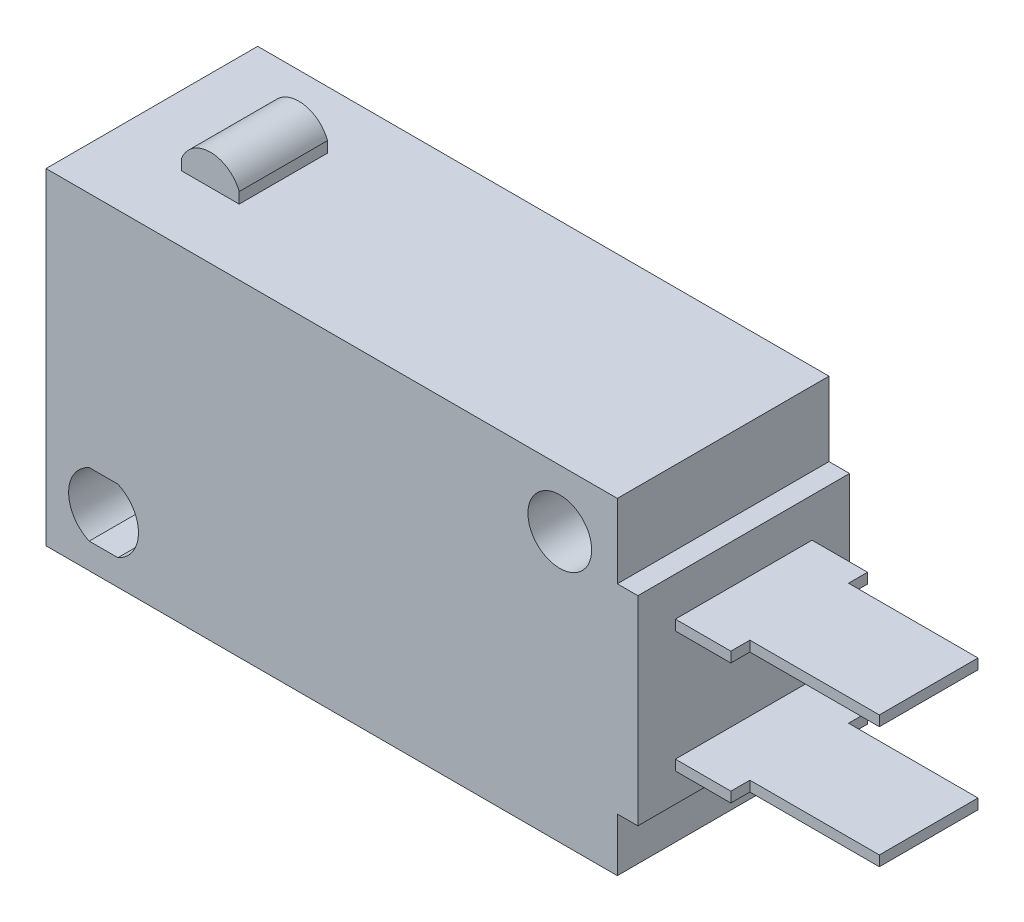
ISO-10303-21;
HEADER;
FILE_DESCRIPTION(('STEP AP214'),'2;1');
FILE_NAME('part.step','',(''),(''),'','','');
FILE_SCHEMA(('AUTOMOTIVE_DESIGN { 1 0 10303 214 1 1 1 1 }'));
ENDSEC;
DATA;
#1=APPLICATION_CONTEXT('core data for automotive mechanical design processes');
#2=APPLICATION_PROTOCOL_DEFINITION('international standard','automotive_design',2000,#1);
#3=PRODUCT_CONTEXT('',#1,'mechanical');
#4=PRODUCT('Part','Part','',(#3));
#5=PRODUCT_RELATED_PRODUCT_CATEGORY('part','',(#4));
#6=PRODUCT_DEFINITION_FORMATION('','',#4);
#7=PRODUCT_DEFINITION_CONTEXT('part definition',#1,'design');
#8=PRODUCT_DEFINITION('design','',#6,#7);
#9=PRODUCT_DEFINITION_SHAPE('','',#8);
#10=(LENGTH_UNIT() NAMED_UNIT(*) SI_UNIT(.MILLI.,.METRE.));
#11=(NAMED_UNIT(*) PLANE_ANGLE_UNIT() SI_UNIT($,.RADIAN.));
#12=(NAMED_UNIT(*) SI_UNIT($,.STERADIAN.) SOLID_ANGLE_UNIT());
#13=UNCERTAINTY_MEASURE_WITH_UNIT(LENGTH_MEASURE(1.E-05),#10,'distance_accuracy_value','');
#14=(GEOMETRIC_REPRESENTATION_CONTEXT(3) GLOBAL_UNCERTAINTY_ASSIGNED_CONTEXT((#13)) GLOBAL_UNIT_ASSIGNED_CONTEXT((#10,
#11,#12)) REPRESENTATION_CONTEXT('',''));
#15=CARTESIAN_POINT('',(0.,0.,0.));
#16=DIRECTION('',(0.,0.,1.));
#17=DIRECTION('',(1.,0.,0.));
#18=AXIS2_PLACEMENT_3D('',#15,#16,#17);
#19=CARTESIAN_POINT('',(3.8,-0.8,5.15));
#20=DIRECTION('',(-1.,0.,0.));
#21=DIRECTION('',(0.,-1.,0.));
#22=AXIS2_PLACEMENT_3D('',#19,#20,#21);
#23=PLANE('',#22);
#24=DIRECTION('',(0.,-1.,0.));
#25=VECTOR('',#24,1.);
#26=CARTESIAN_POINT('',(3.8,-2.7,3.325));
#27=LINE('',#26,#25);
#28=CARTESIAN_POINT('',(3.8,-2.7,3.325));
#29=VERTEX_POINT('',#28);
#30=CARTESIAN_POINT('',(3.8,-3.2,3.325));
#31=VERTEX_POINT('',#30);
#32=EDGE_CURVE('E395',#29,#31,#27,.T.);
#33=ORIENTED_EDGE('',*,*,#32,.F.);
#34=DIRECTION('',(0.,0.,1.));
#35=VECTOR('',#34,1.);
#36=CARTESIAN_POINT('',(3.8,-2.7,3.325));
#37=LINE('',#36,#35);
#38=CARTESIAN_POINT('',(3.8,-2.7,-3.325));
#39=VERTEX_POINT('',#38);
#40=EDGE_CURVE('E404',#39,#29,#37,.T.);
#41=ORIENTED_EDGE('',*,*,#40,.F.);
#42=DIRECTION('',(0.,1.,0.));
#43=VECTOR('',#42,1.);
#44=CARTESIAN_POINT('',(3.8,-2.7,-3.325));
#45=LINE('',#44,#43);
#46=CARTESIAN_POINT('',(3.8,-3.2,-3.325));
#47=VERTEX_POINT('',#46);
#48=EDGE_CURVE('E401',#47,#39,#45,.T.);
#49=ORIENTED_EDGE('',*,*,#48,.F.);
#50=DIRECTION('',(0.,0.,-1.));
#51=VECTOR('',#50,1.);
#52=CARTESIAN_POINT('',(3.8,-3.2,3.325));
#53=LINE('',#52,#51);
#54=EDGE_CURVE('E398',#31,#47,#53,.T.);
#55=ORIENTED_EDGE('',*,*,#54,.F.);
#56=EDGE_LOOP('',(#33,#41,#49,#55));
#57=FACE_BOUND('',#56,.T.);
#58=DIRECTION('',(0.,1.,0.));
#59=VECTOR('',#58,1.);
#60=CARTESIAN_POINT('',(3.8,-0.8,-5.15));
#61=LINE('',#60,#59);
#62=CARTESIAN_POINT('',(3.8,-10.5,-5.15));
#63=VERTEX_POINT('',#62);
#64=CARTESIAN_POINT('',(3.8,-0.8,-5.15));
#65=VERTEX_POINT('',#64);
#66=EDGE_CURVE('E300',#63,#65,#61,.T.);
#67=ORIENTED_EDGE('',*,*,#66,.T.);
#68=DIRECTION('',(0.,0.,-1.));
#69=VECTOR('',#68,1.);
#70=CARTESIAN_POINT('',(3.8,-0.8,5.15));
#71=LINE('',#70,#69);
#72=CARTESIAN_POINT('',(3.8,-0.8,5.15));
#73=VERTEX_POINT('',#72);
#74=EDGE_CURVE('E334',#73,#65,#71,.T.);
#75=ORIENTED_EDGE('',*,*,#74,.F.);
#76=DIRECTION('',(0.,1.,0.));
#77=VECTOR('',#76,1.);
#78=CARTESIAN_POINT('',(3.8,-0.8,5.15));
#79=LINE('',#78,#77);
#80=CARTESIAN_POINT('',(3.8,-10.5,5.15));
#81=VERTEX_POINT('',#80);
#82=EDGE_CURVE('E317',#81,#73,#79,.T.);
#83=ORIENTED_EDGE('',*,*,#82,.F.);
#84=DIRECTION('',(0.,0.,-1.));
#85=VECTOR('',#84,1.);
#86=CARTESIAN_POINT('',(3.8,-10.5,5.15));
#87=LINE('',#86,#85);
#88=EDGE_CURVE('E337',#81,#63,#87,.T.);
#89=ORIENTED_EDGE('',*,*,#88,.T.);
#90=EDGE_LOOP('',(#67,#75,#83,#89));
#91=FACE_BOUND('',#90,.T.);
#92=DIRECTION('',(0.,-1.,0.));
#93=VECTOR('',#92,1.);
#94=CARTESIAN_POINT('',(3.8,-8.6,3.325));
#95=LINE('',#94,#93);
#96=CARTESIAN_POINT('',(3.8,-8.6,3.325));
#97=VERTEX_POINT('',#96);
#98=CARTESIAN_POINT('',(3.8,-9.1,3.325));
#99=VERTEX_POINT('',#98);
#100=EDGE_CURVE('E921',#97,#99,#95,.T.);
#101=ORIENTED_EDGE('',*,*,#100,.F.);
#102=DIRECTION('',(0.,0.,1.));
#103=VECTOR('',#102,1.);
#104=CARTESIAN_POINT('',(3.8,-8.6,3.325));
#105=LINE('',#104,#103);
#106=CARTESIAN_POINT('',(3.8,-8.6,-3.325));
#107=VERTEX_POINT('',#106);
#108=EDGE_CURVE('E379',#107,#97,#105,.T.);
#109=ORIENTED_EDGE('',*,*,#108,.F.);
#110=DIRECTION('',(0.,1.,0.));
#111=VECTOR('',#110,1.);
#112=CARTESIAN_POINT('',(3.8,-8.6,-3.325));
#113=LINE('',#112,#111);
#114=CARTESIAN_POINT('',(3.8,-9.1,-3.325));
#115=VERTEX_POINT('',#114);
#116=EDGE_CURVE('E384',#115,#107,#113,.T.);
#117=ORIENTED_EDGE('',*,*,#116,.F.);
#118=DIRECTION('',(0.,0.,-1.));
#119=VECTOR('',#118,1.);
#120=CARTESIAN_POINT('',(3.8,-9.1,3.325));
#121=LINE('',#120,#119);
#122=EDGE_CURVE('E924',#99,#115,#121,.T.);
#123=ORIENTED_EDGE('',*,*,#122,.F.);
#124=EDGE_LOOP('',(#101,#109,#117,#123));
#125=FACE_BOUND('',#124,.T.);
#126=ADVANCED_FACE('F17',(#57,#91,#125),#23,.F.);
#127=CARTESIAN_POINT('',(-25.,2.8,5.15));
#128=DIRECTION('',(0.,-1.,0.));
#129=DIRECTION('',(0.,0.,-1.));
#130=AXIS2_PLACEMENT_3D('',#127,#128,#129);
#131=PLANE('',#130);
#132=DIRECTION('',(-1.,0.,0.));
#133=VECTOR('',#132,1.);
#134=CARTESIAN_POINT('',(-25.,2.8,-5.15));
#135=LINE('',#134,#133);
#136=CARTESIAN_POINT('',(2.8,2.8,-5.15));
#137=VERTEX_POINT('',#136);
#138=CARTESIAN_POINT('',(-25.,2.8,-5.15));
#139=VERTEX_POINT('',#138);
#140=EDGE_CURVE('E306',#137,#139,#135,.T.);
#141=ORIENTED_EDGE('',*,*,#140,.T.);
#142=DIRECTION('',(0.,0.,-1.));
#143=VECTOR('',#142,1.);
#144=CARTESIAN_POINT('',(-25.,2.8,5.15));
#145=LINE('',#144,#143);
#146=CARTESIAN_POINT('',(-25.,2.8,5.15));
#147=VERTEX_POINT('',#146);
#148=EDGE_CURVE('E325',#147,#139,#145,.T.);
#149=ORIENTED_EDGE('',*,*,#148,.F.);
#150=DIRECTION('',(-1.,0.,0.));
#151=VECTOR('',#150,1.);
#152=CARTESIAN_POINT('',(-25.,2.8,5.15));
#153=LINE('',#152,#151);
#154=CARTESIAN_POINT('',(2.8,2.8,5.15));
#155=VERTEX_POINT('',#154);
#156=EDGE_CURVE('E323',#155,#147,#153,.T.);
#157=ORIENTED_EDGE('',*,*,#156,.F.);
#158=DIRECTION('',(0.,0.,-1.));
#159=VECTOR('',#158,1.);
#160=CARTESIAN_POINT('',(2.8,2.8,5.15));
#161=LINE('',#160,#159);
#162=EDGE_CURVE('E328',#155,#137,#161,.T.);
#163=ORIENTED_EDGE('',*,*,#162,.T.);
#164=EDGE_LOOP('',(#141,#149,#157,#163));
#165=FACE_BOUND('',#164,.T.);
#166=DIRECTION('',(0.,0.,1.));
#167=VECTOR('',#166,1.);
#168=CARTESIAN_POINT('',(-21.6,2.8,-2.35));
#169=LINE('',#168,#167);
#170=CARTESIAN_POINT('',(-21.6,2.8,-2.35));
#171=VERTEX_POINT('',#170);
#172=CARTESIAN_POINT('',(-21.6,2.8,1.95));
#173=VERTEX_POINT('',#172);
#174=EDGE_CURVE('E420',#171,#173,#169,.T.);
#175=ORIENTED_EDGE('',*,*,#174,.F.);
#176=DIRECTION('',(-1.,0.,0.));
#177=VECTOR('',#176,1.);
#178=CARTESIAN_POINT('',(-21.6,2.8,-2.35));
#179=LINE('',#178,#177);
#180=CARTESIAN_POINT('',(-18.8,2.8,-2.35));
#181=VERTEX_POINT('',#180);
#182=EDGE_CURVE('E426',#181,#171,#179,.T.);
#183=ORIENTED_EDGE('',*,*,#182,.F.);
#184=DIRECTION('',(0.,0.,-1.));
#185=VECTOR('',#184,1.);
#186=CARTESIAN_POINT('',(-18.8,2.8,-2.35));
#187=LINE('',#186,#185);
#188=CARTESIAN_POINT('',(-18.8,2.8,1.95));
#189=VERTEX_POINT('',#188);
#190=EDGE_CURVE('E424',#189,#181,#187,.T.);
#191=ORIENTED_EDGE('',*,*,#190,.F.);
#192=DIRECTION('',(1.,0.,0.));
#193=VECTOR('',#192,1.);
#194=CARTESIAN_POINT('',(-21.6,2.8,1.95));
#195=LINE('',#194,#193);
#196=EDGE_CURVE('E246',#173,#189,#195,.T.);
#197=ORIENTED_EDGE('',*,*,#196,.F.);
#198=EDGE_LOOP('',(#175,#183,#191,#197));
#199=FACE_BOUND('',#198,.T.);
#200=ADVANCED_FACE('F433',(#165,#199),#131,.F.);
#201=CARTESIAN_POINT('',(-25.,-13.1,5.15));
#202=DIRECTION('',(0.,0.,1.));
#203=DIRECTION('',(1.,0.,0.));
#204=AXIS2_PLACEMENT_3D('',#201,#202,#203);
#205=PLANE('',#204);
#206=CARTESIAN_POINT('',(0.,0.,5.15));
#207=DIRECTION('',(0.,0.,1.));
#208=DIRECTION('',(1.,0.,0.));
#209=AXIS2_PLACEMENT_3D('',#206,#207,#208);
#210=CIRCLE('',#209,1.55);
#211=CARTESIAN_POINT('',(1.55,0.,5.15));
#212=VERTEX_POINT('',#211);
#213=EDGE_CURVE('E288',#212,#212,#210,.T.);
#214=ORIENTED_EDGE('',*,*,#213,.F.);
#215=EDGE_LOOP('',(#214));
#216=FACE_BOUND('',#215,.T.);
#217=DIRECTION('',(0.,-1.,0.));
#218=VECTOR('',#217,1.);
#219=CARTESIAN_POINT('',(-25.,2.8,5.15));
#220=LINE('',#219,#218);
#221=CARTESIAN_POINT('',(-25.,-13.1,5.15));
#222=VERTEX_POINT('',#221);
#223=EDGE_CURVE('E308',#147,#222,#220,.T.);
#224=ORIENTED_EDGE('',*,*,#223,.T.);
#225=DIRECTION('',(1.,0.,0.));
#226=VECTOR('',#225,1.);
#227=CARTESIAN_POINT('',(-25.,-13.1,5.15));
#228=LINE('',#227,#226);
#229=CARTESIAN_POINT('',(2.8,-13.1,5.15));
#230=VERTEX_POINT('',#229);
#231=EDGE_CURVE('E311',#222,#230,#228,.T.);
#232=ORIENTED_EDGE('',*,*,#231,.T.);
#233=DIRECTION('',(0.,1.,0.));
#234=VECTOR('',#233,1.);
#235=CARTESIAN_POINT('',(2.8,-10.5,5.15));
#236=LINE('',#235,#234);
#237=CARTESIAN_POINT('',(2.8,-10.5,5.15));
#238=VERTEX_POINT('',#237);
#239=EDGE_CURVE('E313',#230,#238,#236,.T.);
#240=ORIENTED_EDGE('',*,*,#239,.T.);
#241=DIRECTION('',(1.,0.,0.));
#242=VECTOR('',#241,1.);
#243=CARTESIAN_POINT('',(3.8,-10.5,5.15));
#244=LINE('',#243,#242);
#245=EDGE_CURVE('E315',#238,#81,#244,.T.);
#246=ORIENTED_EDGE('',*,*,#245,.T.);
#247=ORIENTED_EDGE('',*,*,#82,.T.);
#248=DIRECTION('',(-1.,0.,0.));
#249=VECTOR('',#248,1.);
#250=CARTESIAN_POINT('',(2.8,-0.8,5.15));
#251=LINE('',#250,#249);
#252=CARTESIAN_POINT('',(2.8,-0.8,5.15));
#253=VERTEX_POINT('',#252);
#254=EDGE_CURVE('E319',#73,#253,#251,.T.);
#255=ORIENTED_EDGE('',*,*,#254,.T.);
#256=DIRECTION('',(0.,1.,0.));
#257=VECTOR('',#256,1.);
#258=CARTESIAN_POINT('',(2.8,2.8,5.15));
#259=LINE('',#258,#257);
#260=EDGE_CURVE('E321',#253,#155,#259,.T.);
#261=ORIENTED_EDGE('',*,*,#260,.T.);
#262=ORIENTED_EDGE('',*,*,#156,.T.);
#263=EDGE_LOOP('',(#224,#232,#240,#246,#247,#255,#261,#262));
#264=FACE_BOUND('',#263,.T.);
#265=DIRECTION('',(1.,0.,0.));
#266=VECTOR('',#265,1.);
#267=CARTESIAN_POINT('',(-22.8982120021885,-11.85,5.15));
#268=LINE('',#267,#266);
#269=CARTESIAN_POINT('',(-22.8982120021885,-11.85,5.15));
#270=VERTEX_POINT('',#269);
#271=CARTESIAN_POINT('',(-21.5017879978116,-11.85,5.15));
#272=VERTEX_POINT('',#271);
#273=EDGE_CURVE('E268',#270,#272,#268,.T.);
#274=ORIENTED_EDGE('',*,*,#273,.F.);
#275=CARTESIAN_POINT('',(-22.2,-10.3,5.15));
#276=DIRECTION('',(0.,0.,1.));
#277=DIRECTION('',(1.,0.,0.));
#278=AXIS2_PLACEMENT_3D('',#275,#276,#277);
#279=CIRCLE('',#278,1.7);
#280=CARTESIAN_POINT('',(-22.8982120021885,-8.75,5.15));
#281=VERTEX_POINT('',#280);
#282=EDGE_CURVE('E266',#281,#270,#279,.T.);
#283=ORIENTED_EDGE('',*,*,#282,.F.);
#284=DIRECTION('',(-1.,0.,0.));
#285=VECTOR('',#284,1.);
#286=CARTESIAN_POINT('',(-22.8982120021885,-8.75,5.15));
#287=LINE('',#286,#285);
#288=CARTESIAN_POINT('',(-21.5017879978116,-8.75,5.15));
#289=VERTEX_POINT('',#288);
#290=EDGE_CURVE('E273',#289,#281,#287,.T.);
#291=ORIENTED_EDGE('',*,*,#290,.F.);
#292=CARTESIAN_POINT('',(-22.2,-10.3,5.15));
#293=DIRECTION('',(0.,0.,1.));
#294=DIRECTION('',(1.,0.,0.));
#295=AXIS2_PLACEMENT_3D('',#292,#293,#294);
#296=CIRCLE('',#295,1.7);
#297=EDGE_CURVE('E270',#272,#289,#296,.T.);
#298=ORIENTED_EDGE('',*,*,#297,.F.);
#299=EDGE_LOOP('',(#274,#283,#291,#298));
#300=FACE_BOUND('',#299,.T.);
#301=ADVANCED_FACE('F453',(#216,#264,#300),#205,.T.);
#302=CARTESIAN_POINT('',(-25.,-13.1,-5.15));
#303=DIRECTION('',(0.,0.,1.));
#304=DIRECTION('',(1.,0.,0.));
#305=AXIS2_PLACEMENT_3D('',#302,#303,#304);
#306=PLANE('',#305);
#307=CARTESIAN_POINT('',(0.,0.,-5.15));
#308=DIRECTION('',(0.,0.,1.));
#309=DIRECTION('',(1.,0.,0.));
#310=AXIS2_PLACEMENT_3D('',#307,#308,#309);
#311=CIRCLE('',#310,1.55);
#312=CARTESIAN_POINT('',(1.55,0.,-5.15));
#313=VERTEX_POINT('',#312);
#314=EDGE_CURVE('E285',#313,#313,#311,.T.);
#315=ORIENTED_EDGE('',*,*,#314,.T.);
#316=EDGE_LOOP('',(#315));
#317=FACE_BOUND('',#316,.T.);
#318=DIRECTION('',(0.,-1.,0.));
#319=VECTOR('',#318,1.);
#320=CARTESIAN_POINT('',(-25.,2.8,-5.15));
#321=LINE('',#320,#319);
#322=CARTESIAN_POINT('',(-25.,-13.1,-5.15));
#323=VERTEX_POINT('',#322);
#324=EDGE_CURVE('E291',#139,#323,#321,.T.);
#325=ORIENTED_EDGE('',*,*,#324,.F.);
#326=ORIENTED_EDGE('',*,*,#140,.F.);
#327=DIRECTION('',(0.,1.,0.));
#328=VECTOR('',#327,1.);
#329=CARTESIAN_POINT('',(2.8,2.8,-5.15));
#330=LINE('',#329,#328);
#331=CARTESIAN_POINT('',(2.8,-0.8,-5.15));
#332=VERTEX_POINT('',#331);
#333=EDGE_CURVE('E304',#332,#137,#330,.T.);
#334=ORIENTED_EDGE('',*,*,#333,.F.);
#335=DIRECTION('',(-1.,0.,0.));
#336=VECTOR('',#335,1.);
#337=CARTESIAN_POINT('',(2.8,-0.8,-5.15));
#338=LINE('',#337,#336);
#339=EDGE_CURVE('E302',#65,#332,#338,.T.);
#340=ORIENTED_EDGE('',*,*,#339,.F.);
#341=ORIENTED_EDGE('',*,*,#66,.F.);
#342=DIRECTION('',(1.,0.,0.));
#343=VECTOR('',#342,1.);
#344=CARTESIAN_POINT('',(3.8,-10.5,-5.15));
#345=LINE('',#344,#343);
#346=CARTESIAN_POINT('',(2.8,-10.5,-5.15));
#347=VERTEX_POINT('',#346);
#348=EDGE_CURVE('E298',#347,#63,#345,.T.);
#349=ORIENTED_EDGE('',*,*,#348,.F.);
#350=DIRECTION('',(0.,1.,0.));
#351=VECTOR('',#350,1.);
#352=CARTESIAN_POINT('',(2.8,-10.5,-5.15));
#353=LINE('',#352,#351);
#354=CARTESIAN_POINT('',(2.8,-13.1,-5.15));
#355=VERTEX_POINT('',#354);
#356=EDGE_CURVE('E296',#355,#347,#353,.T.);
#357=ORIENTED_EDGE('',*,*,#356,.F.);
#358=DIRECTION('',(1.,0.,0.));
#359=VECTOR('',#358,1.);
#360=CARTESIAN_POINT('',(-25.,-13.1,-5.15));
#361=LINE('',#360,#359);
#362=EDGE_CURVE('E294',#323,#355,#361,.T.);
#363=ORIENTED_EDGE('',*,*,#362,.F.);
#364=EDGE_LOOP('',(#325,#326,#334,#340,#341,#349,#357,#363));
#365=FACE_BOUND('',#364,.T.);
#366=CARTESIAN_POINT('',(-22.2,-10.3,-5.15));
#367=DIRECTION('',(0.,0.,1.));
#368=DIRECTION('',(1.,0.,0.));
#369=AXIS2_PLACEMENT_3D('',#366,#367,#368);
#370=CIRCLE('',#369,1.7);
#371=CARTESIAN_POINT('',(-22.8982120021885,-8.75,-5.15));
#372=VERTEX_POINT('',#371);
#373=CARTESIAN_POINT('',(-22.8982120021885,-11.85,-5.15));
#374=VERTEX_POINT('',#373);
#375=EDGE_CURVE('E249',#372,#374,#370,.T.);
#376=ORIENTED_EDGE('',*,*,#375,.T.);
#377=DIRECTION('',(1.,0.,0.));
#378=VECTOR('',#377,1.);
#379=CARTESIAN_POINT('',(-22.8982120021885,-11.85,-5.15));
#380=LINE('',#379,#378);
#381=CARTESIAN_POINT('',(-21.5017879978116,-11.85,-5.15));
#382=VERTEX_POINT('',#381);
#383=EDGE_CURVE('E257',#374,#382,#380,.T.);
#384=ORIENTED_EDGE('',*,*,#383,.T.);
#385=CARTESIAN_POINT('',(-22.2,-10.3,-5.15));
#386=DIRECTION('',(0.,0.,1.));
#387=DIRECTION('',(1.,0.,0.));
#388=AXIS2_PLACEMENT_3D('',#385,#386,#387);
#389=CIRCLE('',#388,1.7);
#390=CARTESIAN_POINT('',(-21.5017879978116,-8.75,-5.15));
#391=VERTEX_POINT('',#390);
#392=EDGE_CURVE('E260',#382,#391,#389,.T.);
#393=ORIENTED_EDGE('',*,*,#392,.T.);
#394=DIRECTION('',(-1.,0.,0.));
#395=VECTOR('',#394,1.);
#396=CARTESIAN_POINT('',(-22.8982120021885,-8.75,-5.15));
#397=LINE('',#396,#395);
#398=EDGE_CURVE('E263',#391,#372,#397,.T.);
#399=ORIENTED_EDGE('',*,*,#398,.T.);
#400=EDGE_LOOP('',(#376,#384,#393,#399));
#401=FACE_BOUND('',#400,.T.);
#402=ADVANCED_FACE('F475',(#317,#365,#401),#306,.F.);
#403=CARTESIAN_POINT('',(-25.,2.8,5.15));
#404=DIRECTION('',(1.,0.,0.));
#405=DIRECTION('',(0.,0.,-1.));
#406=AXIS2_PLACEMENT_3D('',#403,#404,#405);
#407=PLANE('',#406);
#408=ORIENTED_EDGE('',*,*,#324,.T.);
#409=DIRECTION('',(0.,0.,-1.));
#410=VECTOR('',#409,1.);
#411=CARTESIAN_POINT('',(-25.,-13.1,5.15));
#412=LINE('',#411,#410);
#413=EDGE_CURVE('E346',#222,#323,#412,.T.);
#414=ORIENTED_EDGE('',*,*,#413,.F.);
#415=ORIENTED_EDGE('',*,*,#223,.F.);
#416=ORIENTED_EDGE('',*,*,#148,.T.);
#417=EDGE_LOOP('',(#408,#414,#415,#416));
#418=FACE_BOUND('',#417,.T.);
#419=ADVANCED_FACE('F19',(#418),#407,.F.);
#420=CARTESIAN_POINT('',(-25.,-13.1,5.15));
#421=DIRECTION('',(0.,1.,0.));
#422=DIRECTION('',(0.,0.,1.));
#423=AXIS2_PLACEMENT_3D('',#420,#421,#422);
#424=PLANE('',#423);
#425=ORIENTED_EDGE('',*,*,#362,.T.);
#426=DIRECTION('',(0.,0.,-1.));
#427=VECTOR('',#426,1.);
#428=CARTESIAN_POINT('',(2.8,-13.1,5.15));
#429=LINE('',#428,#427);
#430=EDGE_CURVE('E343',#230,#355,#429,.T.);
#431=ORIENTED_EDGE('',*,*,#430,.F.);
#432=ORIENTED_EDGE('',*,*,#231,.F.);
#433=ORIENTED_EDGE('',*,*,#413,.T.);
#434=EDGE_LOOP('',(#425,#431,#432,#433));
#435=FACE_BOUND('',#434,.T.);
#436=ADVANCED_FACE('F468',(#435),#424,.F.);
#437=CARTESIAN_POINT('',(2.8,-10.5,5.15));
#438=DIRECTION('',(-1.,0.,0.));
#439=DIRECTION('',(0.,0.,1.));
#440=AXIS2_PLACEMENT_3D('',#437,#438,#439);
#441=PLANE('',#440);
#442=ORIENTED_EDGE('',*,*,#356,.T.);
#443=DIRECTION('',(0.,0.,-1.));
#444=VECTOR('',#443,1.);
#445=CARTESIAN_POINT('',(2.8,-10.5,5.15));
#446=LINE('',#445,#444);
#447=EDGE_CURVE('E340',#238,#347,#446,.T.);
#448=ORIENTED_EDGE('',*,*,#447,.F.);
#449=ORIENTED_EDGE('',*,*,#239,.F.);
#450=ORIENTED_EDGE('',*,*,#430,.T.);
#451=EDGE_LOOP('',(#442,#448,#449,#450));
#452=FACE_BOUND('',#451,.T.);
#453=ADVANCED_FACE('F465',(#452),#441,.F.);
#454=CARTESIAN_POINT('',(3.8,-10.5,5.15));
#455=DIRECTION('',(0.,1.,0.));
#456=DIRECTION('',(0.,0.,1.));
#457=AXIS2_PLACEMENT_3D('',#454,#455,#456);
#458=PLANE('',#457);
#459=ORIENTED_EDGE('',*,*,#348,.T.);
#460=ORIENTED_EDGE('',*,*,#88,.F.);
#461=ORIENTED_EDGE('',*,*,#245,.F.);
#462=ORIENTED_EDGE('',*,*,#447,.T.);
#463=EDGE_LOOP('',(#459,#460,#461,#462));
#464=FACE_BOUND('',#463,.T.);
#465=ADVANCED_FACE('F462',(#464),#458,.F.);
#466=CARTESIAN_POINT('',(2.8,-0.8,5.15));
#467=DIRECTION('',(0.,-1.,0.));
#468=DIRECTION('',(0.,0.,-1.));
#469=AXIS2_PLACEMENT_3D('',#466,#467,#468);
#470=PLANE('',#469);
#471=ORIENTED_EDGE('',*,*,#339,.T.);
#472=DIRECTION('',(0.,0.,-1.));
#473=VECTOR('',#472,1.);
#474=CARTESIAN_POINT('',(2.8,-0.8,5.15));
#475=LINE('',#474,#473);
#476=EDGE_CURVE('E331',#253,#332,#475,.T.);
#477=ORIENTED_EDGE('',*,*,#476,.F.);
#478=ORIENTED_EDGE('',*,*,#254,.F.);
#479=ORIENTED_EDGE('',*,*,#74,.T.);
#480=EDGE_LOOP('',(#471,#477,#478,#479));
#481=FACE_BOUND('',#480,.T.);
#482=ADVANCED_FACE('F460',(#481),#470,.F.);
#483=CARTESIAN_POINT('',(2.8,2.8,5.15));
#484=DIRECTION('',(-1.,0.,0.));
#485=DIRECTION('',(0.,0.,1.));
#486=AXIS2_PLACEMENT_3D('',#483,#484,#485);
#487=PLANE('',#486);
#488=ORIENTED_EDGE('',*,*,#333,.T.);
#489=ORIENTED_EDGE('',*,*,#162,.F.);
#490=ORIENTED_EDGE('',*,*,#260,.F.);
#491=ORIENTED_EDGE('',*,*,#476,.T.);
#492=EDGE_LOOP('',(#488,#489,#490,#491));
#493=FACE_BOUND('',#492,.T.);
#494=ADVANCED_FACE('F505',(#493),#487,.F.);
#495=CARTESIAN_POINT('',(0.,0.,5.15));
#496=DIRECTION('',(0.,0.,-1.));
#497=DIRECTION('',(-1.,0.,0.));
#498=AXIS2_PLACEMENT_3D('',#495,#496,#497);
#499=CYLINDRICAL_SURFACE('',#498,1.55);
#500=ORIENTED_EDGE('',*,*,#213,.T.);
#501=EDGE_LOOP('',(#500));
#502=FACE_BOUND('',#501,.T.);
#503=ORIENTED_EDGE('',*,*,#314,.F.);
#504=EDGE_LOOP('',(#503));
#505=FACE_BOUND('',#504,.T.);
#506=ADVANCED_FACE('F511',(#502,#505),#499,.F.);
#507=CARTESIAN_POINT('',(-22.2,-10.3,5.15));
#508=DIRECTION('',(0.,0.,-1.));
#509=DIRECTION('',(-1.,0.,0.));
#510=AXIS2_PLACEMENT_3D('',#507,#508,#509);
#511=CYLINDRICAL_SURFACE('',#510,1.7);
#512=ORIENTED_EDGE('',*,*,#375,.F.);
#513=DIRECTION('',(0.,0.,-1.));
#514=VECTOR('',#513,1.);
#515=CARTESIAN_POINT('',(-22.8982120021885,-8.75,5.15));
#516=LINE('',#515,#514);
#517=EDGE_CURVE('E275',#281,#372,#516,.T.);
#518=ORIENTED_EDGE('',*,*,#517,.F.);
#519=ORIENTED_EDGE('',*,*,#282,.T.);
#520=DIRECTION('',(0.,0.,-1.));
#521=VECTOR('',#520,1.);
#522=CARTESIAN_POINT('',(-22.8982120021885,-11.85,5.15));
#523=LINE('',#522,#521);
#524=EDGE_CURVE('E282',#270,#374,#523,.T.);
#525=ORIENTED_EDGE('',*,*,#524,.T.);
#526=EDGE_LOOP('',(#512,#518,#519,#525));
#527=FACE_BOUND('',#526,.T.);
#528=ADVANCED_FACE('F515',(#527),#511,.F.);
#529=CARTESIAN_POINT('',(-22.8982120021885,-11.85,5.15));
#530=DIRECTION('',(0.,1.,0.));
#531=DIRECTION('',(0.,0.,1.));
#532=AXIS2_PLACEMENT_3D('',#529,#530,#531);
#533=PLANE('',#532);
#534=ORIENTED_EDGE('',*,*,#383,.F.);
#535=ORIENTED_EDGE('',*,*,#524,.F.);
#536=ORIENTED_EDGE('',*,*,#273,.T.);
#537=DIRECTION('',(0.,0.,-1.));
#538=VECTOR('',#537,1.);
#539=CARTESIAN_POINT('',(-21.5017879978116,-11.85,5.15));
#540=LINE('',#539,#538);
#541=EDGE_CURVE('E280',#272,#382,#540,.T.);
#542=ORIENTED_EDGE('',*,*,#541,.T.);
#543=EDGE_LOOP('',(#534,#535,#536,#542));
#544=FACE_BOUND('',#543,.T.);
#545=ADVANCED_FACE('F527',(#544),#533,.T.);
#546=CARTESIAN_POINT('',(-22.2,-10.3,5.15));
#547=DIRECTION('',(0.,0.,-1.));
#548=DIRECTION('',(-1.,0.,0.));
#549=AXIS2_PLACEMENT_3D('',#546,#547,#548);
#550=CYLINDRICAL_SURFACE('',#549,1.7);
#551=ORIENTED_EDGE('',*,*,#392,.F.);
#552=ORIENTED_EDGE('',*,*,#541,.F.);
#553=ORIENTED_EDGE('',*,*,#297,.T.);
#554=DIRECTION('',(0.,0.,-1.));
#555=VECTOR('',#554,1.);
#556=CARTESIAN_POINT('',(-21.5017879978116,-8.75,5.15));
#557=LINE('',#556,#555);
#558=EDGE_CURVE('E278',#289,#391,#557,.T.);
#559=ORIENTED_EDGE('',*,*,#558,.T.);
#560=EDGE_LOOP('',(#551,#552,#553,#559));
#561=FACE_BOUND('',#560,.T.);
#562=ADVANCED_FACE('F531',(#561),#550,.F.);
#563=CARTESIAN_POINT('',(-22.8982120021885,-8.75,5.15));
#564=DIRECTION('',(0.,-1.,0.));
#565=DIRECTION('',(0.,0.,-1.));
#566=AXIS2_PLACEMENT_3D('',#563,#564,#565);
#567=PLANE('',#566);
#568=ORIENTED_EDGE('',*,*,#398,.F.);
#569=ORIENTED_EDGE('',*,*,#558,.F.);
#570=ORIENTED_EDGE('',*,*,#290,.T.);
#571=ORIENTED_EDGE('',*,*,#517,.T.);
#572=EDGE_LOOP('',(#568,#569,#570,#571));
#573=FACE_BOUND('',#572,.T.);
#574=ADVANCED_FACE('F535',(#573),#567,.T.);
#575=CARTESIAN_POINT('',(-21.6,4.29,-2.35));
#576=DIRECTION('',(1.,0.,0.));
#577=DIRECTION('',(0.,0.,-1.));
#578=AXIS2_PLACEMENT_3D('',#575,#576,#577);
#579=PLANE('',#578);
#580=DIRECTION('',(0.,-1.,0.));
#581=VECTOR('',#580,1.);
#582=CARTESIAN_POINT('',(-21.6,4.29,1.95));
#583=LINE('',#582,#581);
#584=CARTESIAN_POINT('',(-21.6,3.32851648071344,1.95));
#585=VERTEX_POINT('',#584);
#586=EDGE_CURVE('E247',#585,#173,#583,.T.);
#587=ORIENTED_EDGE('',*,*,#586,.F.);
#588=DIRECTION('',(0.,0.,1.));
#589=VECTOR('',#588,1.);
#590=CARTESIAN_POINT('',(-21.6,3.32851648071344,-5.15));
#591=LINE('',#590,#589);
#592=CARTESIAN_POINT('',(-21.6,3.32851648071344,-2.35));
#593=VERTEX_POINT('',#592);
#594=EDGE_CURVE('E231',#593,#585,#591,.T.);
#595=ORIENTED_EDGE('',*,*,#594,.F.);
#596=DIRECTION('',(0.,-1.,0.));
#597=VECTOR('',#596,1.);
#598=CARTESIAN_POINT('',(-21.6,4.29,-2.35));
#599=LINE('',#598,#597);
#600=EDGE_CURVE('E251',#593,#171,#599,.T.);
#601=ORIENTED_EDGE('',*,*,#600,.T.);
#602=ORIENTED_EDGE('',*,*,#174,.T.);
#603=EDGE_LOOP('',(#587,#595,#601,#602));
#604=FACE_BOUND('',#603,.T.);
#605=ADVANCED_FACE('F430',(#604),#579,.F.);
#606=CARTESIAN_POINT('',(-21.6,4.29,1.95));
#607=DIRECTION('',(0.,0.,-1.));
#608=DIRECTION('',(-1.,0.,0.));
#609=AXIS2_PLACEMENT_3D('',#606,#607,#608);
#610=PLANE('',#609);
#611=DIRECTION('',(0.,-1.,0.));
#612=VECTOR('',#611,1.);
#613=CARTESIAN_POINT('',(-18.8,4.29,1.95));
#614=LINE('',#613,#612);
#615=CARTESIAN_POINT('',(-18.8,3.32851648071344,1.95));
#616=VERTEX_POINT('',#615);
#617=EDGE_CURVE('E239',#616,#189,#614,.T.);
#618=ORIENTED_EDGE('',*,*,#617,.F.);
#619=CARTESIAN_POINT('',(-20.2,2.79,1.95));
#620=DIRECTION('',(0.,0.,-1.));
#621=DIRECTION('',(-1.,0.,0.));
#622=AXIS2_PLACEMENT_3D('',#619,#620,#621);
#623=CIRCLE('',#622,1.5);
#624=EDGE_CURVE('E225',#585,#616,#623,.T.);
#625=ORIENTED_EDGE('',*,*,#624,.F.);
#626=ORIENTED_EDGE('',*,*,#586,.T.);
#627=ORIENTED_EDGE('',*,*,#196,.T.);
#628=EDGE_LOOP('',(#618,#625,#626,#627));
#629=FACE_BOUND('',#628,.T.);
#630=ADVANCED_FACE('F244',(#629),#610,.F.);
#631=CARTESIAN_POINT('',(-18.8,4.29,-2.35));
#632=DIRECTION('',(-1.,0.,0.));
#633=DIRECTION('',(0.,0.,1.));
#634=AXIS2_PLACEMENT_3D('',#631,#632,#633);
#635=PLANE('',#634);
#636=DIRECTION('',(0.,-1.,0.));
#637=VECTOR('',#636,1.);
#638=CARTESIAN_POINT('',(-18.8,4.29,-2.35));
#639=LINE('',#638,#637);
#640=CARTESIAN_POINT('',(-18.8,3.32851648071344,-2.35));
#641=VERTEX_POINT('',#640);
#642=EDGE_CURVE('E241',#641,#181,#639,.T.);
#643=ORIENTED_EDGE('',*,*,#642,.F.);
#644=DIRECTION('',(0.,0.,1.));
#645=VECTOR('',#644,1.);
#646=CARTESIAN_POINT('',(-18.8,3.32851648071344,-5.15));
#647=LINE('',#646,#645);
#648=EDGE_CURVE('E228',#641,#616,#647,.T.);
#649=ORIENTED_EDGE('',*,*,#648,.T.);
#650=ORIENTED_EDGE('',*,*,#617,.T.);
#651=ORIENTED_EDGE('',*,*,#190,.T.);
#652=EDGE_LOOP('',(#643,#649,#650,#651));
#653=FACE_BOUND('',#652,.T.);
#654=ADVANCED_FACE('F237',(#653),#635,.F.);
#655=CARTESIAN_POINT('',(-21.6,4.29,-2.35));
#656=DIRECTION('',(0.,0.,1.));
#657=DIRECTION('',(1.,0.,0.));
#658=AXIS2_PLACEMENT_3D('',#655,#656,#657);
#659=PLANE('',#658);
#660=ORIENTED_EDGE('',*,*,#600,.F.);
#661=CARTESIAN_POINT('',(-20.2,2.79,-2.35));
#662=DIRECTION('',(0.,0.,1.));
#663=DIRECTION('',(1.,0.,0.));
#664=AXIS2_PLACEMENT_3D('',#661,#662,#663);
#665=CIRCLE('',#664,1.5);
#666=EDGE_CURVE('E32',#593,#641,#665,.F.);
#667=ORIENTED_EDGE('',*,*,#666,.T.);
#668=ORIENTED_EDGE('',*,*,#642,.T.);
#669=ORIENTED_EDGE('',*,*,#182,.T.);
#670=EDGE_LOOP('',(#660,#667,#668,#669));
#671=FACE_BOUND('',#670,.T.);
#672=ADVANCED_FACE('F434',(#671),#659,.F.);
#673=CARTESIAN_POINT('',(12.8,-2.7,3.325));
#674=DIRECTION('',(0.,0.,-1.));
#675=DIRECTION('',(0.,1.,0.));
#676=AXIS2_PLACEMENT_3D('',#673,#674,#675);
#677=PLANE('',#676);
#678=DIRECTION('',(-1.,0.,0.));
#679=VECTOR('',#678,1.);
#680=CARTESIAN_POINT('',(12.8,-3.2,3.325));
#681=LINE('',#680,#679);
#682=CARTESIAN_POINT('',(6.5,-3.2,3.325));
#683=VERTEX_POINT('',#682);
#684=EDGE_CURVE('E418',#683,#31,#681,.T.);
#685=ORIENTED_EDGE('',*,*,#684,.F.);
#686=DIRECTION('',(0.,1.,0.));
#687=VECTOR('',#686,1.);
#688=CARTESIAN_POINT('',(6.5,-13.1,3.325));
#689=LINE('',#688,#687);
#690=CARTESIAN_POINT('',(6.5,-2.7,3.325));
#691=VERTEX_POINT('',#690);
#692=EDGE_CURVE('E898',#683,#691,#689,.T.);
#693=ORIENTED_EDGE('',*,*,#692,.T.);
#694=DIRECTION('',(-1.,0.,0.));
#695=VECTOR('',#694,1.);
#696=CARTESIAN_POINT('',(12.8,-2.7,3.325));
#697=LINE('',#696,#695);
#698=EDGE_CURVE('E412',#691,#29,#697,.T.);
#699=ORIENTED_EDGE('',*,*,#698,.T.);
#700=ORIENTED_EDGE('',*,*,#32,.T.);
#701=EDGE_LOOP('',(#685,#693,#699,#700));
#702=FACE_BOUND('',#701,.T.);
#703=ADVANCED_FACE('F436',(#702),#677,.F.);
#704=CARTESIAN_POINT('',(12.8,-3.2,3.325));
#705=DIRECTION('',(0.,1.,0.));
#706=DIRECTION('',(-1.,0.,0.));
#707=AXIS2_PLACEMENT_3D('',#704,#705,#706);
#708=PLANE('',#707);
#709=DIRECTION('',(0.,0.,1.));
#710=VECTOR('',#709,1.);
#711=CARTESIAN_POINT('',(6.5,-3.2,3.325));
#712=LINE('',#711,#710);
#713=CARTESIAN_POINT('',(6.5,-3.2,-3.325));
#714=VERTEX_POINT('',#713);
#715=CARTESIAN_POINT('',(6.5,-3.2,-2.4));
#716=VERTEX_POINT('',#715);
#717=EDGE_CURVE('E890',#714,#716,#712,.T.);
#718=ORIENTED_EDGE('',*,*,#717,.T.);
#719=DIRECTION('',(1.,0.,0.));
#720=VECTOR('',#719,1.);
#721=CARTESIAN_POINT('',(12.8,-3.2,-2.4));
#722=LINE('',#721,#720);
#723=CARTESIAN_POINT('',(12.8,-3.2,-2.4));
#724=VERTEX_POINT('',#723);
#725=EDGE_CURVE('E374',#716,#724,#722,.T.);
#726=ORIENTED_EDGE('',*,*,#725,.T.);
#727=DIRECTION('',(0.,0.,-1.));
#728=VECTOR('',#727,1.);
#729=CARTESIAN_POINT('',(12.8,-3.2,3.325));
#730=LINE('',#729,#728);
#731=CARTESIAN_POINT('',(12.8,-3.2,2.4));
#732=VERTEX_POINT('',#731);
#733=EDGE_CURVE('E407',#732,#724,#730,.T.);
#734=ORIENTED_EDGE('',*,*,#733,.F.);
#735=DIRECTION('',(-1.,0.,0.));
#736=VECTOR('',#735,1.);
#737=CARTESIAN_POINT('',(12.8,-3.2,2.4));
#738=LINE('',#737,#736);
#739=CARTESIAN_POINT('',(6.5,-3.2,2.4));
#740=VERTEX_POINT('',#739);
#741=EDGE_CURVE('E912',#732,#740,#738,.T.);
#742=ORIENTED_EDGE('',*,*,#741,.T.);
#743=DIRECTION('',(0.,0.,1.));
#744=VECTOR('',#743,1.);
#745=CARTESIAN_POINT('',(6.5,-3.2,3.325));
#746=LINE('',#745,#744);
#747=EDGE_CURVE('E918',#740,#683,#746,.T.);
#748=ORIENTED_EDGE('',*,*,#747,.T.);
#749=ORIENTED_EDGE('',*,*,#684,.T.);
#750=ORIENTED_EDGE('',*,*,#54,.T.);
#751=DIRECTION('',(-1.,0.,0.));
#752=VECTOR('',#751,1.);
#753=CARTESIAN_POINT('',(12.8,-3.2,-3.325));
#754=LINE('',#753,#752);
#755=EDGE_CURVE('E416',#714,#47,#754,.T.);
#756=ORIENTED_EDGE('',*,*,#755,.F.);
#757=EDGE_LOOP('',(#718,#726,#734,#742,#748,#749,#750,#756));
#758=FACE_BOUND('',#757,.T.);
#759=ADVANCED_FACE('F443',(#758),#708,.F.);
#760=CARTESIAN_POINT('',(12.8,-2.7,-3.325));
#761=DIRECTION('',(0.,0.,1.));
#762=DIRECTION('',(0.,-1.,0.));
#763=AXIS2_PLACEMENT_3D('',#760,#761,#762);
#764=PLANE('',#763);
#765=DIRECTION('',(-1.,0.,0.));
#766=VECTOR('',#765,1.);
#767=CARTESIAN_POINT('',(12.8,-2.7,-3.325));
#768=LINE('',#767,#766);
#769=CARTESIAN_POINT('',(6.5,-2.7,-3.325));
#770=VERTEX_POINT('',#769);
#771=EDGE_CURVE('E414',#770,#39,#768,.T.);
#772=ORIENTED_EDGE('',*,*,#771,.F.);
#773=DIRECTION('',(0.,1.,0.));
#774=VECTOR('',#773,1.);
#775=CARTESIAN_POINT('',(6.5,-13.1,-3.325));
#776=LINE('',#775,#774);
#777=EDGE_CURVE('E876',#714,#770,#776,.T.);
#778=ORIENTED_EDGE('',*,*,#777,.F.);
#779=ORIENTED_EDGE('',*,*,#755,.T.);
#780=ORIENTED_EDGE('',*,*,#48,.T.);
#781=EDGE_LOOP('',(#772,#778,#779,#780));
#782=FACE_BOUND('',#781,.T.);
#783=ADVANCED_FACE('F671',(#782),#764,.F.);
#784=CARTESIAN_POINT('',(12.8,-2.7,3.325));
#785=DIRECTION('',(0.,-1.,0.));
#786=DIRECTION('',(1.,0.,0.));
#787=AXIS2_PLACEMENT_3D('',#784,#785,#786);
#788=PLANE('',#787);
#789=DIRECTION('',(0.,0.,1.));
#790=VECTOR('',#789,1.);
#791=CARTESIAN_POINT('',(12.8,-2.7,3.325));
#792=LINE('',#791,#790);
#793=CARTESIAN_POINT('',(12.8,-2.7,-2.4));
#794=VERTEX_POINT('',#793);
#795=CARTESIAN_POINT('',(12.8,-2.7,2.4));
#796=VERTEX_POINT('',#795);
#797=EDGE_CURVE('E410',#794,#796,#792,.T.);
#798=ORIENTED_EDGE('',*,*,#797,.F.);
#799=DIRECTION('',(1.,0.,0.));
#800=VECTOR('',#799,1.);
#801=CARTESIAN_POINT('',(12.8,-2.7,-2.4));
#802=LINE('',#801,#800);
#803=CARTESIAN_POINT('',(6.5,-2.7,-2.4));
#804=VERTEX_POINT('',#803);
#805=EDGE_CURVE('E40',#804,#794,#802,.T.);
#806=ORIENTED_EDGE('',*,*,#805,.F.);
#807=DIRECTION('',(0.,0.,1.));
#808=VECTOR('',#807,1.);
#809=CARTESIAN_POINT('',(6.5,-2.7,-3.325));
#810=LINE('',#809,#808);
#811=EDGE_CURVE('E874',#770,#804,#810,.T.);
#812=ORIENTED_EDGE('',*,*,#811,.F.);
#813=ORIENTED_EDGE('',*,*,#771,.T.);
#814=ORIENTED_EDGE('',*,*,#40,.T.);
#815=ORIENTED_EDGE('',*,*,#698,.F.);
#816=DIRECTION('',(0.,0.,1.));
#817=VECTOR('',#816,1.);
#818=CARTESIAN_POINT('',(6.5,-2.7,3.325));
#819=LINE('',#818,#817);
#820=CARTESIAN_POINT('',(6.5,-2.7,2.4));
#821=VERTEX_POINT('',#820);
#822=EDGE_CURVE('E895',#821,#691,#819,.T.);
#823=ORIENTED_EDGE('',*,*,#822,.F.);
#824=DIRECTION('',(-1.,0.,0.));
#825=VECTOR('',#824,1.);
#826=CARTESIAN_POINT('',(12.8,-2.7,2.4));
#827=LINE('',#826,#825);
#828=EDGE_CURVE('E892',#796,#821,#827,.T.);
#829=ORIENTED_EDGE('',*,*,#828,.F.);
#830=EDGE_LOOP('',(#798,#806,#812,#813,#814,#815,#823,#829));
#831=FACE_BOUND('',#830,.T.);
#832=ADVANCED_FACE('F681',(#831),#788,.F.);
#833=CARTESIAN_POINT('',(12.8,-3.2,3.325));
#834=DIRECTION('',(1.,0.,0.));
#835=DIRECTION('',(0.,0.,-1.));
#836=AXIS2_PLACEMENT_3D('',#833,#834,#835);
#837=PLANE('',#836);
#838=DIRECTION('',(0.,1.,0.));
#839=VECTOR('',#838,1.);
#840=CARTESIAN_POINT('',(12.8,-13.1,-2.4));
#841=LINE('',#840,#839);
#842=EDGE_CURVE('E885',#724,#794,#841,.T.);
#843=ORIENTED_EDGE('',*,*,#842,.T.);
#844=ORIENTED_EDGE('',*,*,#797,.T.);
#845=DIRECTION('',(0.,1.,0.));
#846=VECTOR('',#845,1.);
#847=CARTESIAN_POINT('',(12.8,-13.1,2.4));
#848=LINE('',#847,#846);
#849=EDGE_CURVE('E897',#732,#796,#848,.T.);
#850=ORIENTED_EDGE('',*,*,#849,.F.);
#851=ORIENTED_EDGE('',*,*,#733,.T.);
#852=EDGE_LOOP('',(#843,#844,#850,#851));
#853=FACE_BOUND('',#852,.T.);
#854=ADVANCED_FACE('F692',(#853),#837,.T.);
#855=CARTESIAN_POINT('',(12.8,-8.6,3.325));
#856=DIRECTION('',(0.,0.,-1.));
#857=DIRECTION('',(0.,1.,0.));
#858=AXIS2_PLACEMENT_3D('',#855,#856,#857);
#859=PLANE('',#858);
#860=DIRECTION('',(-1.,0.,0.));
#861=VECTOR('',#860,1.);
#862=CARTESIAN_POINT('',(12.8,-9.1,3.325));
#863=LINE('',#862,#861);
#864=CARTESIAN_POINT('',(6.5,-9.1,3.325));
#865=VERTEX_POINT('',#864);
#866=EDGE_CURVE('E393',#865,#99,#863,.T.);
#867=ORIENTED_EDGE('',*,*,#866,.F.);
#868=CARTESIAN_POINT('',(6.5,-8.6,3.325));
#869=VERTEX_POINT('',#868);
#870=EDGE_CURVE('E901',#865,#869,#689,.T.);
#871=ORIENTED_EDGE('',*,*,#870,.T.);
#872=DIRECTION('',(-1.,0.,0.));
#873=VECTOR('',#872,1.);
#874=CARTESIAN_POINT('',(12.8,-8.6,3.325));
#875=LINE('',#874,#873);
#876=EDGE_CURVE('E381',#869,#97,#875,.T.);
#877=ORIENTED_EDGE('',*,*,#876,.T.);
#878=ORIENTED_EDGE('',*,*,#100,.T.);
#879=EDGE_LOOP('',(#867,#871,#877,#878));
#880=FACE_BOUND('',#879,.T.);
#881=ADVANCED_FACE('F703',(#880),#859,.F.);
#882=CARTESIAN_POINT('',(12.8,-9.1,3.325));
#883=DIRECTION('',(0.,1.,0.));
#884=DIRECTION('',(-1.,0.,0.));
#885=AXIS2_PLACEMENT_3D('',#882,#883,#884);
#886=PLANE('',#885);
#887=DIRECTION('',(0.,0.,1.));
#888=VECTOR('',#887,1.);
#889=CARTESIAN_POINT('',(6.5,-9.1,3.325));
#890=LINE('',#889,#888);
#891=CARTESIAN_POINT('',(6.5,-9.1,-3.325));
#892=VERTEX_POINT('',#891);
#893=CARTESIAN_POINT('',(6.5,-9.1,-2.4));
#894=VERTEX_POINT('',#893);
#895=EDGE_CURVE('E373',#892,#894,#890,.T.);
#896=ORIENTED_EDGE('',*,*,#895,.T.);
#897=DIRECTION('',(1.,0.,0.));
#898=VECTOR('',#897,1.);
#899=CARTESIAN_POINT('',(12.8,-9.1,-2.4));
#900=LINE('',#899,#898);
#901=CARTESIAN_POINT('',(12.8,-9.1,-2.4));
#902=VERTEX_POINT('',#901);
#903=EDGE_CURVE('E359',#894,#902,#900,.T.);
#904=ORIENTED_EDGE('',*,*,#903,.T.);
#905=DIRECTION('',(0.,0.,-1.));
#906=VECTOR('',#905,1.);
#907=CARTESIAN_POINT('',(12.8,-9.1,3.325));
#908=LINE('',#907,#906);
#909=CARTESIAN_POINT('',(12.8,-9.1,2.4));
#910=VERTEX_POINT('',#909);
#911=EDGE_CURVE('E371',#910,#902,#908,.T.);
#912=ORIENTED_EDGE('',*,*,#911,.F.);
#913=DIRECTION('',(-1.,0.,0.));
#914=VECTOR('',#913,1.);
#915=CARTESIAN_POINT('',(12.8,-9.1,2.4));
#916=LINE('',#915,#914);
#917=CARTESIAN_POINT('',(6.5,-9.1,2.4));
#918=VERTEX_POINT('',#917);
#919=EDGE_CURVE('E910',#910,#918,#916,.T.);
#920=ORIENTED_EDGE('',*,*,#919,.T.);
#921=DIRECTION('',(0.,0.,1.));
#922=VECTOR('',#921,1.);
#923=CARTESIAN_POINT('',(6.5,-9.1,3.325));
#924=LINE('',#923,#922);
#925=EDGE_CURVE('E915',#918,#865,#924,.T.);
#926=ORIENTED_EDGE('',*,*,#925,.T.);
#927=ORIENTED_EDGE('',*,*,#866,.T.);
#928=ORIENTED_EDGE('',*,*,#122,.T.);
#929=DIRECTION('',(-1.,0.,0.));
#930=VECTOR('',#929,1.);
#931=CARTESIAN_POINT('',(12.8,-9.1,-3.325));
#932=LINE('',#931,#930);
#933=EDGE_CURVE('E391',#892,#115,#932,.T.);
#934=ORIENTED_EDGE('',*,*,#933,.F.);
#935=EDGE_LOOP('',(#896,#904,#912,#920,#926,#927,#928,#934));
#936=FACE_BOUND('',#935,.T.);
#937=ADVANCED_FACE('F369',(#936),#886,.F.);
#938=CARTESIAN_POINT('',(12.8,-8.6,-3.325));
#939=DIRECTION('',(0.,0.,1.));
#940=DIRECTION('',(1.,0.,0.));
#941=AXIS2_PLACEMENT_3D('',#938,#939,#940);
#942=PLANE('',#941);
#943=DIRECTION('',(-1.,0.,0.));
#944=VECTOR('',#943,1.);
#945=CARTESIAN_POINT('',(12.8,-8.6,-3.325));
#946=LINE('',#945,#944);
#947=CARTESIAN_POINT('',(6.5,-8.6,-3.325));
#948=VERTEX_POINT('',#947);
#949=EDGE_CURVE('E389',#948,#107,#946,.T.);
#950=ORIENTED_EDGE('',*,*,#949,.F.);
#951=EDGE_CURVE('E871',#892,#948,#776,.T.);
#952=ORIENTED_EDGE('',*,*,#951,.F.);
#953=ORIENTED_EDGE('',*,*,#933,.T.);
#954=ORIENTED_EDGE('',*,*,#116,.T.);
#955=EDGE_LOOP('',(#950,#952,#953,#954));
#956=FACE_BOUND('',#955,.T.);
#957=ADVANCED_FACE('F724',(#956),#942,.F.);
#958=CARTESIAN_POINT('',(12.8,-8.6,3.325));
#959=DIRECTION('',(0.,-1.,0.));
#960=DIRECTION('',(1.,0.,0.));
#961=AXIS2_PLACEMENT_3D('',#958,#959,#960);
#962=PLANE('',#961);
#963=DIRECTION('',(0.,0.,1.));
#964=VECTOR('',#963,1.);
#965=CARTESIAN_POINT('',(12.8,-8.6,3.325));
#966=LINE('',#965,#964);
#967=CARTESIAN_POINT('',(12.8,-8.6,-2.4));
#968=VERTEX_POINT('',#967);
#969=CARTESIAN_POINT('',(12.8,-8.6,2.4));
#970=VERTEX_POINT('',#969);
#971=EDGE_CURVE('E378',#968,#970,#966,.T.);
#972=ORIENTED_EDGE('',*,*,#971,.F.);
#973=DIRECTION('',(-1.,0.,0.));
#974=VECTOR('',#973,1.);
#975=CARTESIAN_POINT('',(12.8,-8.6,-2.4));
#976=LINE('',#975,#974);
#977=CARTESIAN_POINT('',(6.5,-8.6,-2.4));
#978=VERTEX_POINT('',#977);
#979=EDGE_CURVE('E362',#968,#978,#976,.T.);
#980=ORIENTED_EDGE('',*,*,#979,.T.);
#981=DIRECTION('',(0.,0.,-1.));
#982=VECTOR('',#981,1.);
#983=CARTESIAN_POINT('',(6.5,-8.6,3.325));
#984=LINE('',#983,#982);
#985=EDGE_CURVE('E11',#978,#948,#984,.T.);
#986=ORIENTED_EDGE('',*,*,#985,.T.);
#987=ORIENTED_EDGE('',*,*,#949,.T.);
#988=ORIENTED_EDGE('',*,*,#108,.T.);
#989=ORIENTED_EDGE('',*,*,#876,.F.);
#990=DIRECTION('',(0.,0.,-1.));
#991=VECTOR('',#990,1.);
#992=CARTESIAN_POINT('',(6.5,-8.6,3.325));
#993=LINE('',#992,#991);
#994=CARTESIAN_POINT('',(6.5,-8.6,2.4));
#995=VERTEX_POINT('',#994);
#996=EDGE_CURVE('E352',#869,#995,#993,.T.);
#997=ORIENTED_EDGE('',*,*,#996,.T.);
#998=DIRECTION('',(1.,0.,0.));
#999=VECTOR('',#998,1.);
#1000=CARTESIAN_POINT('',(12.8,-8.6,2.4));
#1001=LINE('',#1000,#999);
#1002=EDGE_CURVE('E907',#995,#970,#1001,.T.);
#1003=ORIENTED_EDGE('',*,*,#1002,.T.);
#1004=EDGE_LOOP('',(#972,#980,#986,#987,#988,#989,#997,#1003));
#1005=FACE_BOUND('',#1004,.T.);
#1006=ADVANCED_FACE('F734',(#1005),#962,.F.);
#1007=CARTESIAN_POINT('',(12.8,-9.1,3.325));
#1008=DIRECTION('',(1.,0.,0.));
#1009=DIRECTION('',(0.,0.,-1.));
#1010=AXIS2_PLACEMENT_3D('',#1007,#1008,#1009);
#1011=PLANE('',#1010);
#1012=DIRECTION('',(0.,-1.,0.));
#1013=VECTOR('',#1012,1.);
#1014=CARTESIAN_POINT('',(12.8,-9.1,-2.4));
#1015=LINE('',#1014,#1013);
#1016=EDGE_CURVE('E25',#968,#902,#1015,.T.);
#1017=ORIENTED_EDGE('',*,*,#1016,.F.);
#1018=ORIENTED_EDGE('',*,*,#971,.T.);
#1019=DIRECTION('',(0.,1.,0.));
#1020=VECTOR('',#1019,1.);
#1021=CARTESIAN_POINT('',(12.8,-9.1,2.4));
#1022=LINE('',#1021,#1020);
#1023=EDGE_CURVE('E349',#910,#970,#1022,.T.);
#1024=ORIENTED_EDGE('',*,*,#1023,.F.);
#1025=ORIENTED_EDGE('',*,*,#911,.T.);
#1026=EDGE_LOOP('',(#1017,#1018,#1024,#1025));
#1027=FACE_BOUND('',#1026,.T.);
#1028=ADVANCED_FACE('F377',(#1027),#1011,.T.);
#1029=CARTESIAN_POINT('',(12.8,-13.1,2.4));
#1030=DIRECTION('',(0.,0.,-1.));
#1031=DIRECTION('',(0.,1.,0.));
#1032=AXIS2_PLACEMENT_3D('',#1029,#1030,#1031);
#1033=PLANE('',#1032);
#1034=ORIENTED_EDGE('',*,*,#1023,.T.);
#1035=ORIENTED_EDGE('',*,*,#1002,.F.);
#1036=DIRECTION('',(0.,1.,0.));
#1037=VECTOR('',#1036,1.);
#1038=CARTESIAN_POINT('',(6.5,-13.1,2.4));
#1039=LINE('',#1038,#1037);
#1040=EDGE_CURVE('E902',#918,#995,#1039,.T.);
#1041=ORIENTED_EDGE('',*,*,#1040,.F.);
#1042=ORIENTED_EDGE('',*,*,#919,.F.);
#1043=EDGE_LOOP('',(#1034,#1035,#1041,#1042));
#1044=FACE_BOUND('',#1043,.T.);
#1045=ADVANCED_FACE('F755',(#1044),#1033,.F.);
#1046=CARTESIAN_POINT('',(6.5,-13.1,3.325));
#1047=DIRECTION('',(-1.,0.,0.));
#1048=DIRECTION('',(0.,-1.,0.));
#1049=AXIS2_PLACEMENT_3D('',#1046,#1047,#1048);
#1050=PLANE('',#1049);
#1051=ORIENTED_EDGE('',*,*,#1040,.T.);
#1052=ORIENTED_EDGE('',*,*,#996,.F.);
#1053=ORIENTED_EDGE('',*,*,#870,.F.);
#1054=ORIENTED_EDGE('',*,*,#925,.F.);
#1055=EDGE_LOOP('',(#1051,#1052,#1053,#1054));
#1056=FACE_BOUND('',#1055,.T.);
#1057=ADVANCED_FACE('F765',(#1056),#1050,.F.);
#1058=EDGE_CURVE('E903',#740,#821,#1039,.T.);
#1059=ORIENTED_EDGE('',*,*,#1058,.T.);
#1060=ORIENTED_EDGE('',*,*,#822,.T.);
#1061=ORIENTED_EDGE('',*,*,#692,.F.);
#1062=ORIENTED_EDGE('',*,*,#747,.F.);
#1063=EDGE_LOOP('',(#1059,#1060,#1061,#1062));
#1064=FACE_BOUND('',#1063,.T.);
#1065=ADVANCED_FACE('F777',(#1064),#1050,.F.);
#1066=ORIENTED_EDGE('',*,*,#849,.T.);
#1067=ORIENTED_EDGE('',*,*,#828,.T.);
#1068=ORIENTED_EDGE('',*,*,#1058,.F.);
#1069=ORIENTED_EDGE('',*,*,#741,.F.);
#1070=EDGE_LOOP('',(#1066,#1067,#1068,#1069));
#1071=FACE_BOUND('',#1070,.T.);
#1072=ADVANCED_FACE('F768',(#1071),#1033,.F.);
#1073=CARTESIAN_POINT('',(12.8,-13.1,-2.4));
#1074=DIRECTION('',(0.,0.,1.));
#1075=DIRECTION('',(0.,-1.,0.));
#1076=AXIS2_PLACEMENT_3D('',#1073,#1074,#1075);
#1077=PLANE('',#1076);
#1078=DIRECTION('',(0.,1.,0.));
#1079=VECTOR('',#1078,1.);
#1080=CARTESIAN_POINT('',(6.5,-13.1,-2.4));
#1081=LINE('',#1080,#1079);
#1082=EDGE_CURVE('E870',#894,#978,#1081,.T.);
#1083=ORIENTED_EDGE('',*,*,#1082,.T.);
#1084=ORIENTED_EDGE('',*,*,#979,.F.);
#1085=ORIENTED_EDGE('',*,*,#1016,.T.);
#1086=ORIENTED_EDGE('',*,*,#903,.F.);
#1087=EDGE_LOOP('',(#1083,#1084,#1085,#1086));
#1088=FACE_BOUND('',#1087,.T.);
#1089=ADVANCED_FACE('F358',(#1088),#1077,.F.);
#1090=CARTESIAN_POINT('',(6.5,-13.1,-3.325));
#1091=DIRECTION('',(-1.,0.,0.));
#1092=DIRECTION('',(0.,-1.,0.));
#1093=AXIS2_PLACEMENT_3D('',#1090,#1091,#1092);
#1094=PLANE('',#1093);
#1095=ORIENTED_EDGE('',*,*,#951,.T.);
#1096=ORIENTED_EDGE('',*,*,#985,.F.);
#1097=ORIENTED_EDGE('',*,*,#1082,.F.);
#1098=ORIENTED_EDGE('',*,*,#895,.F.);
#1099=EDGE_LOOP('',(#1095,#1096,#1097,#1098));
#1100=FACE_BOUND('',#1099,.T.);
#1101=ADVANCED_FACE('F806',(#1100),#1094,.F.);
#1102=ORIENTED_EDGE('',*,*,#777,.T.);
#1103=ORIENTED_EDGE('',*,*,#811,.T.);
#1104=EDGE_CURVE('E866',#716,#804,#1081,.T.);
#1105=ORIENTED_EDGE('',*,*,#1104,.F.);
#1106=ORIENTED_EDGE('',*,*,#717,.F.);
#1107=EDGE_LOOP('',(#1102,#1103,#1105,#1106));
#1108=FACE_BOUND('',#1107,.T.);
#1109=ADVANCED_FACE('F817',(#1108),#1094,.F.);
#1110=ORIENTED_EDGE('',*,*,#1104,.T.);
#1111=ORIENTED_EDGE('',*,*,#805,.T.);
#1112=ORIENTED_EDGE('',*,*,#842,.F.);
#1113=ORIENTED_EDGE('',*,*,#725,.F.);
#1114=EDGE_LOOP('',(#1110,#1111,#1112,#1113));
#1115=FACE_BOUND('',#1114,.T.);
#1116=ADVANCED_FACE('F808',(#1115),#1077,.F.);
#1117=CARTESIAN_POINT('',(-20.2,2.79,-5.15));
#1118=DIRECTION('',(0.,0.,1.));
#1119=DIRECTION('',(1.,0.,0.));
#1120=AXIS2_PLACEMENT_3D('',#1117,#1118,#1119);
#1121=CYLINDRICAL_SURFACE('',#1120,1.5);
#1122=ORIENTED_EDGE('',*,*,#594,.T.);
#1123=ORIENTED_EDGE('',*,*,#624,.T.);
#1124=ORIENTED_EDGE('',*,*,#648,.F.);
#1125=ORIENTED_EDGE('',*,*,#666,.F.);
#1126=EDGE_LOOP('',(#1122,#1123,#1124,#1125));
#1127=FACE_BOUND('',#1126,.T.);
#1128=ADVANCED_FACE('F227',(#1127),#1121,.T.);
#1129=CLOSED_SHELL('',(#126,#200,#301,#402,#419,#436,#453,#465,#482,#494,#506,#528,#545,#562,
#574,#605,#630,#654,#672,#703,#759,#783,#832,#854,#881,#937,#957,#1006,#1028,#1045,#1057,#1065,
#1072,#1089,#1101,#1109,#1116,#1128));
#1130=MANIFOLD_SOLID_BREP('B1',#1129);
#1131=ADVANCED_BREP_SHAPE_REPRESENTATION('',(#18,#1130),#14);
#1132=SHAPE_DEFINITION_REPRESENTATION(#9,#1131);
ENDSEC;
END-ISO-10303-21;
